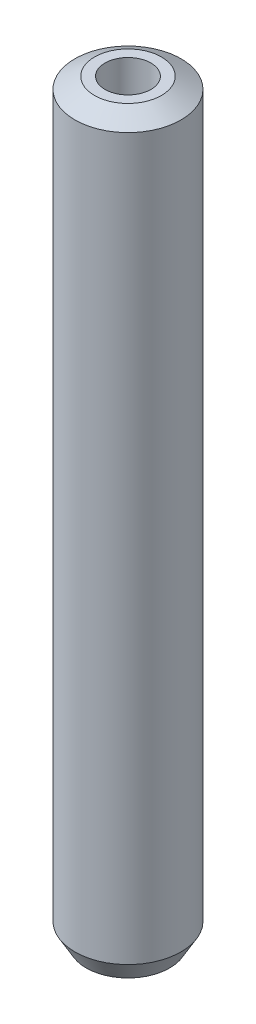
ISO-10303-21;
HEADER;
FILE_DESCRIPTION(('STEP AP214'),'2;1');
FILE_NAME('part.step','',(''),(''),'','','');
FILE_SCHEMA(('AUTOMOTIVE_DESIGN { 1 0 10303 214 1 1 1 1 }'));
ENDSEC;
DATA;
#1=APPLICATION_CONTEXT('core data for automotive mechanical design processes');
#2=APPLICATION_PROTOCOL_DEFINITION('international standard','automotive_design',2000,#1);
#3=PRODUCT_CONTEXT('',#1,'mechanical');
#4=PRODUCT('Part','Part','',(#3));
#5=PRODUCT_RELATED_PRODUCT_CATEGORY('part','',(#4));
#6=PRODUCT_DEFINITION_FORMATION('','',#4);
#7=PRODUCT_DEFINITION_CONTEXT('part definition',#1,'design');
#8=PRODUCT_DEFINITION('design','',#6,#7);
#9=PRODUCT_DEFINITION_SHAPE('','',#8);
#10=(LENGTH_UNIT() NAMED_UNIT(*) SI_UNIT(.MILLI.,.METRE.));
#11=(NAMED_UNIT(*) PLANE_ANGLE_UNIT() SI_UNIT($,.RADIAN.));
#12=(NAMED_UNIT(*) SI_UNIT($,.STERADIAN.) SOLID_ANGLE_UNIT());
#13=UNCERTAINTY_MEASURE_WITH_UNIT(LENGTH_MEASURE(1.E-05),#10,'distance_accuracy_value','');
#14=(GEOMETRIC_REPRESENTATION_CONTEXT(3) GLOBAL_UNCERTAINTY_ASSIGNED_CONTEXT((#13)) GLOBAL_UNIT_ASSIGNED_CONTEXT((#10,
#11,#12)) REPRESENTATION_CONTEXT('',''));
#15=CARTESIAN_POINT('',(0.,0.,0.));
#16=DIRECTION('',(0.,0.,1.));
#17=DIRECTION('',(1.,0.,0.));
#18=AXIS2_PLACEMENT_3D('',#15,#16,#17);
#19=CARTESIAN_POINT('',(0.,212.484828403681,0.));
#20=DIRECTION('',(0.,-1.,0.));
#21=DIRECTION('',(0.,0.,-1.));
#22=AXIS2_PLACEMENT_3D('',#19,#20,#21);
#23=CYLINDRICAL_SURFACE('',#22,15.);
#24=CARTESIAN_POINT('',(0.,209.27934049423,0.));
#25=DIRECTION('',(0.,1.,0.));
#26=DIRECTION('',(0.,0.,1.));
#27=AXIS2_PLACEMENT_3D('',#24,#25,#26);
#28=CIRCLE('',#27,15.);
#29=CARTESIAN_POINT('',(0.,209.27934049423,15.));
#30=VERTEX_POINT('',#29);
#31=EDGE_CURVE('E50',#30,#30,#28,.F.);
#32=ORIENTED_EDGE('',*,*,#31,.T.);
#33=EDGE_LOOP('',(#32));
#34=FACE_BOUND('',#33,.T.);
#35=CARTESIAN_POINT('',(0.,5.55206792221605,0.));
#36=DIRECTION('',(0.,1.,0.));
#37=DIRECTION('',(0.,0.,1.));
#38=AXIS2_PLACEMENT_3D('',#35,#36,#37);
#39=CIRCLE('',#38,15.);
#40=CARTESIAN_POINT('',(0.,5.55206792221605,15.));
#41=VERTEX_POINT('',#40);
#42=EDGE_CURVE('E51',#41,#41,#39,.T.);
#43=ORIENTED_EDGE('',*,*,#42,.T.);
#44=EDGE_LOOP('',(#43));
#45=FACE_BOUND('',#44,.T.);
#46=ADVANCED_FACE('F39',(#34,#45),#23,.T.);
#47=CARTESIAN_POINT('',(0.,212.484828403681,0.));
#48=DIRECTION('',(0.,1.,0.));
#49=DIRECTION('',(0.,0.,1.));
#50=AXIS2_PLACEMENT_3D('',#47,#48,#49);
#51=PLANE('',#50);
#52=CARTESIAN_POINT('',(0.,212.484828403681,0.));
#53=DIRECTION('',(0.,1.,0.));
#54=DIRECTION('',(0.,0.,1.));
#55=AXIS2_PLACEMENT_3D('',#52,#53,#54);
#56=CIRCLE('',#55,9.44793207778386);
#57=CARTESIAN_POINT('',(0.,212.484828403681,9.44793207778386));
#58=VERTEX_POINT('',#57);
#59=EDGE_CURVE('E54',#58,#58,#56,.T.);
#60=ORIENTED_EDGE('',*,*,#59,.T.);
#61=EDGE_LOOP('',(#60));
#62=FACE_BOUND('',#61,.T.);
#63=CARTESIAN_POINT('',(0.,212.484828403681,0.));
#64=DIRECTION('',(0.,1.,0.));
#65=DIRECTION('',(0.,0.,1.));
#66=AXIS2_PLACEMENT_3D('',#63,#64,#65);
#67=CIRCLE('',#66,6.48996306931661);
#68=CARTESIAN_POINT('',(0.,212.484828403681,6.48996306931661));
#69=VERTEX_POINT('',#68);
#70=EDGE_CURVE('E58',#69,#69,#67,.T.);
#71=ORIENTED_EDGE('',*,*,#70,.F.);
#72=EDGE_LOOP('',(#71));
#73=FACE_BOUND('',#72,.T.);
#74=ADVANCED_FACE('F69',(#62,#73),#51,.T.);
#75=CARTESIAN_POINT('',(0.,0.,0.));
#76=DIRECTION('',(0.,1.,0.));
#77=DIRECTION('',(0.,0.,1.));
#78=AXIS2_PLACEMENT_3D('',#75,#76,#77);
#79=PLANE('',#78);
#80=CARTESIAN_POINT('',(0.,0.,0.));
#81=DIRECTION('',(0.,1.,0.));
#82=DIRECTION('',(0.,0.,1.));
#83=AXIS2_PLACEMENT_3D('',#80,#81,#82);
#84=CIRCLE('',#83,11.7945120905495);
#85=CARTESIAN_POINT('',(0.,0.,11.7945120905495));
#86=VERTEX_POINT('',#85);
#87=EDGE_CURVE('E10',#86,#86,#84,.F.);
#88=ORIENTED_EDGE('',*,*,#87,.T.);
#89=EDGE_LOOP('',(#88));
#90=FACE_BOUND('',#89,.T.);
#91=CARTESIAN_POINT('',(0.,0.,0.));
#92=DIRECTION('',(0.,1.,0.));
#93=DIRECTION('',(0.,0.,1.));
#94=AXIS2_PLACEMENT_3D('',#91,#92,#93);
#95=CIRCLE('',#94,6.48996306931661);
#96=CARTESIAN_POINT('',(0.,0.,6.48996306931661));
#97=VERTEX_POINT('',#96);
#98=EDGE_CURVE('E63',#97,#97,#95,.T.);
#99=ORIENTED_EDGE('',*,*,#98,.T.);
#100=EDGE_LOOP('',(#99));
#101=FACE_BOUND('',#100,.T.);
#102=ADVANCED_FACE('F75',(#90,#101),#79,.F.);
#103=CARTESIAN_POINT('',(0.,212.484828403681,0.));
#104=DIRECTION('',(0.,-1.,0.));
#105=DIRECTION('',(0.,0.,-1.));
#106=AXIS2_PLACEMENT_3D('',#103,#104,#105);
#107=CYLINDRICAL_SURFACE('',#106,6.48996306931661);
#108=ORIENTED_EDGE('',*,*,#70,.T.);
#109=EDGE_LOOP('',(#108));
#110=FACE_BOUND('',#109,.T.);
#111=ORIENTED_EDGE('',*,*,#98,.F.);
#112=EDGE_LOOP('',(#111));
#113=FACE_BOUND('',#112,.T.);
#114=ADVANCED_FACE('F70',(#110,#113),#107,.F.);
#115=CARTESIAN_POINT('',(0.,212.484828403681,0.));
#116=DIRECTION('',(0.,-1.,0.));
#117=DIRECTION('',(0.,0.,-1.));
#118=AXIS2_PLACEMENT_3D('',#115,#116,#117);
#119=CONICAL_SURFACE('',#118,9.44793207778386,1.0471975511966);
#120=ORIENTED_EDGE('',*,*,#31,.F.);
#121=EDGE_LOOP('',(#120));
#122=FACE_BOUND('',#121,.T.);
#123=ORIENTED_EDGE('',*,*,#59,.F.);
#124=EDGE_LOOP('',(#123));
#125=FACE_BOUND('',#124,.T.);
#126=ADVANCED_FACE('F81',(#122,#125),#119,.T.);
#127=CARTESIAN_POINT('',(0.,5.55206792221605,0.));
#128=DIRECTION('',(0.,1.,0.));
#129=DIRECTION('',(0.,0.,1.));
#130=AXIS2_PLACEMENT_3D('',#127,#128,#129);
#131=CONICAL_SURFACE('',#130,15.,0.523598775598301);
#132=CARTESIAN_POINT('',(0.,0.,11.7945120905495));
#133=CARTESIAN_POINT('',(0.,0.0578340408564163,11.8279025896062));
#134=CARTESIAN_POINT('',(0.,0.115668081712833,11.861293088663));
#135=CARTESIAN_POINT('',(0.,0.231336163425668,11.9280740867766));
#136=CARTESIAN_POINT('',(0.,0.289170204282085,11.9614645858333));
#137=CARTESIAN_POINT('',(0.,0.404838285994919,12.0282455839469));
#138=CARTESIAN_POINT('',(0.,0.462672326851337,12.0616360830037));
#139=CARTESIAN_POINT('',(0.,0.578340408564171,12.1284170811172));
#140=CARTESIAN_POINT('',(0.,0.636174449420588,12.161807580174));
#141=CARTESIAN_POINT('',(0.,0.751842531133422,12.2285885782876));
#142=CARTESIAN_POINT('',(0.,0.809676571989839,12.2619790773443));
#143=CARTESIAN_POINT('',(0.,0.925344653702674,12.3287600754579));
#144=CARTESIAN_POINT('',(0.,0.983178694559091,12.3621505745147));
#145=CARTESIAN_POINT('',(0.,1.09884677627193,12.4289315726282));
#146=CARTESIAN_POINT('',(0.,1.15668081712834,12.462322071685));
#147=CARTESIAN_POINT('',(0.,1.27234889884118,12.5291030697985));
#148=CARTESIAN_POINT('',(0.,1.33018293969759,12.5624935688553));
#149=CARTESIAN_POINT('',(0.,1.44585102141043,12.6292745669689));
#150=CARTESIAN_POINT('',(0.,1.50368506226685,12.6626650660256));
#151=CARTESIAN_POINT('',(0.,1.61935314397968,12.7294460641392));
#152=CARTESIAN_POINT('',(0.,1.6771871848361,12.762836563196));
#153=CARTESIAN_POINT('',(0.,1.79285526654893,12.8296175613095));
#154=CARTESIAN_POINT('',(0.,1.85068930740535,12.8630080603663));
#155=CARTESIAN_POINT('',(0.,1.96635738911818,12.9297890584799));
#156=CARTESIAN_POINT('',(0.,2.0241914299746,12.9631795575366));
#157=CARTESIAN_POINT('',(0.,2.13985951168743,13.0299605556502));
#158=CARTESIAN_POINT('',(0.,2.19769355254385,13.063351054707));
#159=CARTESIAN_POINT('',(0.,2.31336163425669,13.1301320528205));
#160=CARTESIAN_POINT('',(0.,2.3711956751131,13.1635225518773));
#161=CARTESIAN_POINT('',(0.,2.48686375682594,13.2303035499908));
#162=CARTESIAN_POINT('',(0.,2.54469779768235,13.2636940490476));
#163=CARTESIAN_POINT('',(0.,2.66036587939519,13.3304750471612));
#164=CARTESIAN_POINT('',(0.,2.71819992025161,13.363865546218));
#165=CARTESIAN_POINT('',(0.,2.83386800196444,13.4306465443315));
#166=CARTESIAN_POINT('',(0.,2.89170204282086,13.4640370433883));
#167=CARTESIAN_POINT('',(0.,3.00737012453369,13.5308180415018));
#168=CARTESIAN_POINT('',(0.,3.06520416539011,13.5642085405586));
#169=CARTESIAN_POINT('',(0.,3.18087224710294,13.6309895386722));
#170=CARTESIAN_POINT('',(0.,3.23870628795936,13.6643800377289));
#171=CARTESIAN_POINT('',(0.,3.35437436967219,13.7311610358425));
#172=CARTESIAN_POINT('',(0.,3.41220841052861,13.7645515348993));
#173=CARTESIAN_POINT('',(0.,3.52787649224145,13.8313325330128));
#174=CARTESIAN_POINT('',(0.,3.58571053309786,13.8647230320696));
#175=CARTESIAN_POINT('',(0.,3.7013786148107,13.9315040301832));
#176=CARTESIAN_POINT('',(0.,3.75921265566712,13.9648945292399));
#177=CARTESIAN_POINT('',(0.,3.87488073737995,14.0316755273535));
#178=CARTESIAN_POINT('',(0.,3.93271477823637,14.0650660264103));
#179=CARTESIAN_POINT('',(0.,4.0483828599492,14.1318470245238));
#180=CARTESIAN_POINT('',(0.,4.10621690080562,14.1652375235806));
#181=CARTESIAN_POINT('',(0.,4.22188498251845,14.2320185216941));
#182=CARTESIAN_POINT('',(0.,4.27971902337487,14.2654090207509));
#183=CARTESIAN_POINT('',(0.,4.3953871050877,14.3321900188645));
#184=CARTESIAN_POINT('',(0.,4.45322114594412,14.3655805179212));
#185=CARTESIAN_POINT('',(0.,4.56888922765695,14.4323615160348));
#186=CARTESIAN_POINT('',(0.,4.62672326851337,14.4657520150916));
#187=CARTESIAN_POINT('',(0.,4.74239135022621,14.5325330132051));
#188=CARTESIAN_POINT('',(0.,4.80022539108262,14.5659235122619));
#189=CARTESIAN_POINT('',(0.,4.91589347279546,14.6327045103755));
#190=CARTESIAN_POINT('',(0.,4.97372751365188,14.6660950094322));
#191=CARTESIAN_POINT('',(0.,5.08939559536471,14.7328760075458));
#192=CARTESIAN_POINT('',(0.,5.14722963622113,14.7662665066026));
#193=CARTESIAN_POINT('',(0.,5.26289771793396,14.8330475047161));
#194=CARTESIAN_POINT('',(0.,5.32073175879038,14.8664380037729));
#195=CARTESIAN_POINT('',(0.,5.43639984050321,14.9332190018864));
#196=CARTESIAN_POINT('',(0.,5.49423388135963,14.9666095009432));
#197=CARTESIAN_POINT('',(0.,5.55206792221605,15.));
#198=B_SPLINE_CURVE_WITH_KNOTS('',3,(#132,#133,#134,#135,#136,#137,#138,#139,#140,#141,#142,
#143,#144,#145,#146,#147,#148,#149,#150,#151,#152,#153,#154,#155,#156,#157,#158,#159,#160,#161,
#162,#163,#164,#165,#166,#167,#168,#169,#170,#171,#172,#173,#174,#175,#176,#177,#178,#179,#180,
#181,#182,#183,#184,#185,#186,#187,#188,#189,#190,#191,#192,#193,#194,#195,#196,#197),
.UNSPECIFIED.,.F.,.F.,(4,2,2,2,2,2,2,2,2,2,2,2,2,2,2,2,2,2,2,2,2,2,2,2,2,2,2,2,2,2,2,2,4),(0.,
0.200342994340658,0.400685988681315,0.601028983021973,0.801371977362631,1.00171497170329,
1.20205796604395,1.4024009603846,1.60274395472526,1.80308694906592,2.00342994340658,
2.20377293774723,2.40411593208789,2.60445892642855,2.80480192076921,3.00514491510987,
3.20548790945053,3.40583090379118,3.60617389813184,3.8065168924725,4.00685988681316,
4.20720288115381,4.40754587549447,4.60788886983513,4.80823186417579,5.00857485851645,
5.2089178528571,5.40926084719776,5.60960384153842,5.80994683587908,6.01028983021973,
6.21063282456039,6.41097581890105),.UNSPECIFIED.);
#199=EDGE_CURVE('BSEAM45',#86,#41,#198,.T.);
#200=ORIENTED_EDGE('',*,*,#87,.F.);
#201=ORIENTED_EDGE('',*,*,#42,.F.);
#202=ORIENTED_EDGE('',*,*,#199,.T.);
#203=ORIENTED_EDGE('',*,*,#199,.F.);
#204=EDGE_LOOP('',(#200,#202,#201,#203));
#205=FACE_BOUND('',#204,.T.);
#206=ADVANCED_FACE('F45',(#205),#131,.T.);
#207=CLOSED_SHELL('',(#46,#74,#102,#114,#126,#206));
#208=MANIFOLD_SOLID_BREP('B2',#207);
#209=ADVANCED_BREP_SHAPE_REPRESENTATION('',(#18,#208),#14);
#210=SHAPE_DEFINITION_REPRESENTATION(#9,#209);
ENDSEC;
END-ISO-10303-21;
